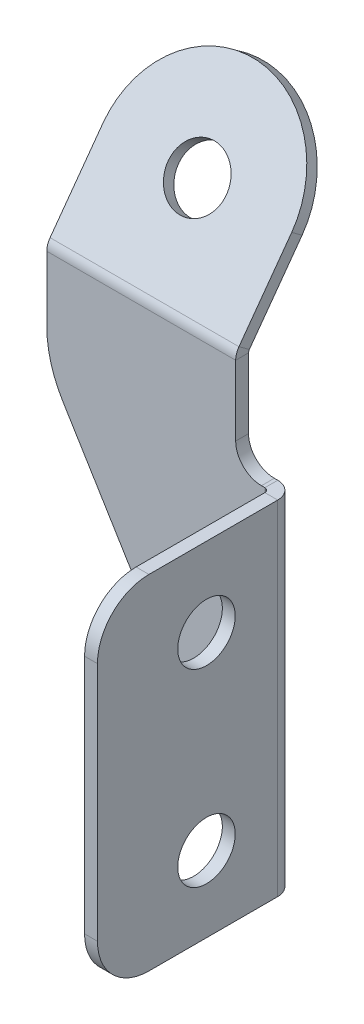
ISO-10303-21;
HEADER;
FILE_DESCRIPTION(('STEP AP214'),'2;1');
FILE_NAME('part.step','',(''),(''),'','','');
FILE_SCHEMA(('AUTOMOTIVE_DESIGN { 1 0 10303 214 1 1 1 1 }'));
ENDSEC;
DATA;
#1=APPLICATION_CONTEXT('core data for automotive mechanical design processes');
#2=APPLICATION_PROTOCOL_DEFINITION('international standard','automotive_design',2000,#1);
#3=PRODUCT_CONTEXT('',#1,'mechanical');
#4=PRODUCT('Part','Part','',(#3));
#5=PRODUCT_RELATED_PRODUCT_CATEGORY('part','',(#4));
#6=PRODUCT_DEFINITION_FORMATION('','',#4);
#7=PRODUCT_DEFINITION_CONTEXT('part definition',#1,'design');
#8=PRODUCT_DEFINITION('design','',#6,#7);
#9=PRODUCT_DEFINITION_SHAPE('','',#8);
#10=(LENGTH_UNIT() NAMED_UNIT(*) SI_UNIT(.MILLI.,.METRE.));
#11=(NAMED_UNIT(*) PLANE_ANGLE_UNIT() SI_UNIT($,.RADIAN.));
#12=(NAMED_UNIT(*) SI_UNIT($,.STERADIAN.) SOLID_ANGLE_UNIT());
#13=UNCERTAINTY_MEASURE_WITH_UNIT(LENGTH_MEASURE(1.E-05),#10,'distance_accuracy_value','');
#14=(GEOMETRIC_REPRESENTATION_CONTEXT(3) GLOBAL_UNCERTAINTY_ASSIGNED_CONTEXT((#13)) GLOBAL_UNIT_ASSIGNED_CONTEXT((#10,
#11,#12)) REPRESENTATION_CONTEXT('',''));
#15=CARTESIAN_POINT('',(0.,0.,0.));
#16=DIRECTION('',(0.,0.,1.));
#17=DIRECTION('',(1.,0.,0.));
#18=AXIS2_PLACEMENT_3D('',#15,#16,#17);
#19=CARTESIAN_POINT('',(147.6,23.2,0.));
#20=DIRECTION('',(1.,0.,0.));
#21=DIRECTION('',(0.,1.,0.));
#22=AXIS2_PLACEMENT_3D('',#19,#20,#21);
#23=PLANE('',#22);
#24=DIRECTION('',(0.,0.,-1.));
#25=VECTOR('',#24,1.);
#26=CARTESIAN_POINT('',(147.6,31.3501606075342,0.));
#27=LINE('',#26,#25);
#28=CARTESIAN_POINT('',(147.6,31.3501606075342,1.5));
#29=VERTEX_POINT('',#28);
#30=CARTESIAN_POINT('',(147.6,31.3501606075342,0.));
#31=VERTEX_POINT('',#30);
#32=EDGE_CURVE('E11',#29,#31,#27,.T.);
#33=ORIENTED_EDGE('',*,*,#32,.F.);
#34=DIRECTION('',(0.,1.,0.));
#35=VECTOR('',#34,1.);
#36=CARTESIAN_POINT('',(147.6,23.2,1.5));
#37=LINE('',#36,#35);
#38=CARTESIAN_POINT('',(147.6,23.2,1.5));
#39=VERTEX_POINT('',#38);
#40=EDGE_CURVE('E121',#39,#29,#37,.T.);
#41=ORIENTED_EDGE('',*,*,#40,.F.);
#42=DIRECTION('',(0.,0.,-1.));
#43=VECTOR('',#42,1.);
#44=CARTESIAN_POINT('',(147.6,23.2,0.));
#45=LINE('',#44,#43);
#46=CARTESIAN_POINT('',(147.6,23.2,0.));
#47=VERTEX_POINT('',#46);
#48=EDGE_CURVE('E48',#39,#47,#45,.T.);
#49=ORIENTED_EDGE('',*,*,#48,.T.);
#50=DIRECTION('',(0.,1.,0.));
#51=VECTOR('',#50,1.);
#52=CARTESIAN_POINT('',(147.6,23.2,0.));
#53=LINE('',#52,#51);
#54=EDGE_CURVE('E124',#47,#31,#53,.T.);
#55=ORIENTED_EDGE('',*,*,#54,.T.);
#56=EDGE_LOOP('',(#33,#41,#49,#55));
#57=FACE_BOUND('',#56,.T.);
#58=ADVANCED_FACE('F38',(#57),#23,.T.);
#59=CARTESIAN_POINT('',(150.6,23.2,0.));
#60=DIRECTION('',(0.,0.,-1.));
#61=DIRECTION('',(-1.,0.,0.));
#62=AXIS2_PLACEMENT_3D('',#59,#60,#61);
#63=CYLINDRICAL_SURFACE('',#62,3.);
#64=ORIENTED_EDGE('',*,*,#48,.F.);
#65=CARTESIAN_POINT('',(150.6,23.2,1.5));
#66=DIRECTION('',(0.,0.,-1.));
#67=DIRECTION('',(-1.,0.,0.));
#68=AXIS2_PLACEMENT_3D('',#65,#66,#67);
#69=CIRCLE('',#68,3.);
#70=CARTESIAN_POINT('',(150.6,20.2,1.5));
#71=VERTEX_POINT('',#70);
#72=EDGE_CURVE('E151',#71,#39,#69,.T.);
#73=ORIENTED_EDGE('',*,*,#72,.F.);
#74=DIRECTION('',(0.,0.,-1.));
#75=VECTOR('',#74,1.);
#76=CARTESIAN_POINT('',(150.6,20.2,0.));
#77=LINE('',#76,#75);
#78=CARTESIAN_POINT('',(150.6,20.2,0.));
#79=VERTEX_POINT('',#78);
#80=EDGE_CURVE('E216',#71,#79,#77,.T.);
#81=ORIENTED_EDGE('',*,*,#80,.T.);
#82=CARTESIAN_POINT('',(150.6,23.2,0.));
#83=DIRECTION('',(0.,0.,-1.));
#84=DIRECTION('',(1.,0.,0.));
#85=AXIS2_PLACEMENT_3D('',#82,#83,#84);
#86=CIRCLE('',#85,3.);
#87=EDGE_CURVE('E230',#79,#47,#86,.T.);
#88=ORIENTED_EDGE('',*,*,#87,.T.);
#89=EDGE_LOOP('',(#64,#73,#81,#88));
#90=FACE_BOUND('',#89,.T.);
#91=ADVANCED_FACE('F238',(#90),#63,.F.);
#92=CARTESIAN_POINT('',(153.,20.2,0.));
#93=DIRECTION('',(0.,1.,0.));
#94=DIRECTION('',(-1.,0.,0.));
#95=AXIS2_PLACEMENT_3D('',#92,#93,#94);
#96=PLANE('',#95);
#97=ORIENTED_EDGE('',*,*,#80,.F.);
#98=DIRECTION('',(1.,0.,0.));
#99=VECTOR('',#98,1.);
#100=CARTESIAN_POINT('',(150.6,20.2,1.5));
#101=LINE('',#100,#99);
#102=CARTESIAN_POINT('',(151.,20.2,1.5));
#103=VERTEX_POINT('',#102);
#104=EDGE_CURVE('E317',#103,#71,#101,.F.);
#105=ORIENTED_EDGE('',*,*,#104,.F.);
#106=DIRECTION('',(0.,0.,-1.));
#107=VECTOR('',#106,1.);
#108=CARTESIAN_POINT('',(151.,20.2,0.));
#109=LINE('',#108,#107);
#110=CARTESIAN_POINT('',(151.,20.2,0.));
#111=VERTEX_POINT('',#110);
#112=EDGE_CURVE('E214',#103,#111,#109,.T.);
#113=ORIENTED_EDGE('',*,*,#112,.T.);
#114=DIRECTION('',(-1.,0.,0.));
#115=VECTOR('',#114,1.);
#116=CARTESIAN_POINT('',(153.,20.2,0.));
#117=LINE('',#116,#115);
#118=EDGE_CURVE('E239',#111,#79,#117,.T.);
#119=ORIENTED_EDGE('',*,*,#118,.T.);
#120=EDGE_LOOP('',(#97,#105,#113,#119));
#121=FACE_BOUND('',#120,.T.);
#122=ADVANCED_FACE('F338',(#121),#96,.T.);
#123=CARTESIAN_POINT('',(151.,20.2,2.));
#124=DIRECTION('',(0.,-1.,0.));
#125=DIRECTION('',(0.,0.,-1.));
#126=AXIS2_PLACEMENT_3D('',#123,#124,#125);
#127=PLANE('',#126);
#128=ORIENTED_EDGE('',*,*,#112,.F.);
#129=CARTESIAN_POINT('',(151.,20.2,2.));
#130=DIRECTION('',(0.,1.,0.));
#131=DIRECTION('',(0.,0.,1.));
#132=AXIS2_PLACEMENT_3D('',#129,#130,#131);
#133=CIRCLE('',#132,0.5);
#134=CARTESIAN_POINT('',(151.5,20.2,2.));
#135=VERTEX_POINT('',#134);
#136=EDGE_CURVE('E163',#103,#135,#133,.F.);
#137=ORIENTED_EDGE('',*,*,#136,.T.);
#138=DIRECTION('',(1.,0.,0.));
#139=VECTOR('',#138,1.);
#140=CARTESIAN_POINT('',(153.,20.2,2.));
#141=LINE('',#140,#139);
#142=CARTESIAN_POINT('',(153.,20.2,2.));
#143=VERTEX_POINT('',#142);
#144=EDGE_CURVE('E211',#135,#143,#141,.T.);
#145=ORIENTED_EDGE('',*,*,#144,.T.);
#146=CARTESIAN_POINT('',(151.,20.2,2.));
#147=DIRECTION('',(0.,1.,0.));
#148=DIRECTION('',(0.,0.,1.));
#149=AXIS2_PLACEMENT_3D('',#146,#147,#148);
#150=CIRCLE('',#149,2.);
#151=EDGE_CURVE('E287',#111,#143,#150,.F.);
#152=ORIENTED_EDGE('',*,*,#151,.F.);
#153=EDGE_LOOP('',(#128,#137,#145,#152));
#154=FACE_BOUND('',#153,.T.);
#155=ADVANCED_FACE('F346',(#154),#127,.F.);
#156=CARTESIAN_POINT('',(153.,20.2,1.5));
#157=DIRECTION('',(0.,1.,0.));
#158=DIRECTION('',(0.,0.,-1.));
#159=AXIS2_PLACEMENT_3D('',#156,#157,#158);
#160=PLANE('',#159);
#161=ORIENTED_EDGE('',*,*,#144,.F.);
#162=DIRECTION('',(0.,0.,1.));
#163=VECTOR('',#162,1.);
#164=CARTESIAN_POINT('',(151.5,20.2,1.5));
#165=LINE('',#164,#163);
#166=CARTESIAN_POINT('',(151.5,20.2,16.9999999999742));
#167=VERTEX_POINT('',#166);
#168=EDGE_CURVE('E161',#167,#135,#165,.F.);
#169=ORIENTED_EDGE('',*,*,#168,.F.);
#170=DIRECTION('',(1.,0.,0.));
#171=VECTOR('',#170,1.);
#172=CARTESIAN_POINT('',(153.,20.2,16.9999999999742));
#173=LINE('',#172,#171);
#174=CARTESIAN_POINT('',(153.,20.2,16.9999999999742));
#175=VERTEX_POINT('',#174);
#176=EDGE_CURVE('E208',#167,#175,#173,.T.);
#177=ORIENTED_EDGE('',*,*,#176,.T.);
#178=DIRECTION('',(0.,0.,-1.));
#179=VECTOR('',#178,1.);
#180=CARTESIAN_POINT('',(153.,20.2,1.5));
#181=LINE('',#180,#179);
#182=EDGE_CURVE('E281',#175,#143,#181,.T.);
#183=ORIENTED_EDGE('',*,*,#182,.T.);
#184=EDGE_LOOP('',(#161,#169,#177,#183));
#185=FACE_BOUND('',#184,.T.);
#186=ADVANCED_FACE('F420',(#185),#160,.T.);
#187=CARTESIAN_POINT('',(153.,14.2,16.9999999999742));
#188=DIRECTION('',(1.,0.,0.));
#189=DIRECTION('',(0.,0.,-1.));
#190=AXIS2_PLACEMENT_3D('',#187,#188,#189);
#191=CYLINDRICAL_SURFACE('',#190,6.);
#192=ORIENTED_EDGE('',*,*,#176,.F.);
#193=CARTESIAN_POINT('',(151.5,14.2,16.9999999999742));
#194=DIRECTION('',(1.,0.,0.));
#195=DIRECTION('',(0.,0.,-1.));
#196=AXIS2_PLACEMENT_3D('',#193,#194,#195);
#197=CIRCLE('',#196,6.);
#198=CARTESIAN_POINT('',(151.5,14.2,22.9999999999742));
#199=VERTEX_POINT('',#198);
#200=EDGE_CURVE('E327',#167,#199,#197,.T.);
#201=ORIENTED_EDGE('',*,*,#200,.T.);
#202=DIRECTION('',(1.,0.,0.));
#203=VECTOR('',#202,1.);
#204=CARTESIAN_POINT('',(153.,14.2,22.9999999999742));
#205=LINE('',#204,#203);
#206=CARTESIAN_POINT('',(153.,14.2,22.9999999999742));
#207=VERTEX_POINT('',#206);
#208=EDGE_CURVE('E205',#199,#207,#205,.T.);
#209=ORIENTED_EDGE('',*,*,#208,.T.);
#210=CARTESIAN_POINT('',(153.,14.2,16.9999999999742));
#211=DIRECTION('',(1.,0.,0.));
#212=DIRECTION('',(0.,0.,-1.));
#213=AXIS2_PLACEMENT_3D('',#210,#211,#212);
#214=CIRCLE('',#213,6.);
#215=EDGE_CURVE('E416',#175,#207,#214,.T.);
#216=ORIENTED_EDGE('',*,*,#215,.F.);
#217=EDGE_LOOP('',(#192,#201,#209,#216));
#218=FACE_BOUND('',#217,.T.);
#219=ADVANCED_FACE('F427',(#218),#191,.T.);
#220=CARTESIAN_POINT('',(153.,14.2,22.9999999999742));
#221=DIRECTION('',(0.,0.,-1.));
#222=DIRECTION('',(0.,-1.,0.));
#223=AXIS2_PLACEMENT_3D('',#220,#221,#222);
#224=PLANE('',#223);
#225=ORIENTED_EDGE('',*,*,#208,.F.);
#226=DIRECTION('',(0.,1.,0.));
#227=VECTOR('',#226,1.);
#228=CARTESIAN_POINT('',(151.5,-19.8,22.9999999999742));
#229=LINE('',#228,#227);
#230=CARTESIAN_POINT('',(151.5,-13.8,22.9999999999742));
#231=VERTEX_POINT('',#230);
#232=EDGE_CURVE('E324',#199,#231,#229,.F.);
#233=ORIENTED_EDGE('',*,*,#232,.T.);
#234=DIRECTION('',(1.,0.,0.));
#235=VECTOR('',#234,1.);
#236=CARTESIAN_POINT('',(153.,-13.8,22.9999999999742));
#237=LINE('',#236,#235);
#238=CARTESIAN_POINT('',(153.,-13.8,22.9999999999742));
#239=VERTEX_POINT('',#238);
#240=EDGE_CURVE('E202',#231,#239,#237,.T.);
#241=ORIENTED_EDGE('',*,*,#240,.T.);
#242=DIRECTION('',(0.,-1.,0.));
#243=VECTOR('',#242,1.);
#244=CARTESIAN_POINT('',(153.,14.2,22.9999999999742));
#245=LINE('',#244,#243);
#246=EDGE_CURVE('E412',#207,#239,#245,.T.);
#247=ORIENTED_EDGE('',*,*,#246,.F.);
#248=EDGE_LOOP('',(#225,#233,#241,#247));
#249=FACE_BOUND('',#248,.T.);
#250=ADVANCED_FACE('F433',(#249),#224,.F.);
#251=CARTESIAN_POINT('',(153.,-13.8,16.9999999999742));
#252=DIRECTION('',(1.,0.,0.));
#253=DIRECTION('',(0.,0.,-1.));
#254=AXIS2_PLACEMENT_3D('',#251,#252,#253);
#255=CYLINDRICAL_SURFACE('',#254,5.99999999999999);
#256=ORIENTED_EDGE('',*,*,#240,.F.);
#257=CARTESIAN_POINT('',(151.5,-13.8,16.9999999999742));
#258=DIRECTION('',(1.,0.,0.));
#259=DIRECTION('',(0.,0.,-1.));
#260=AXIS2_PLACEMENT_3D('',#257,#258,#259);
#261=CIRCLE('',#260,5.99999999999999);
#262=CARTESIAN_POINT('',(151.5,-19.8,16.9999999999742));
#263=VERTEX_POINT('',#262);
#264=EDGE_CURVE('E321',#231,#263,#261,.T.);
#265=ORIENTED_EDGE('',*,*,#264,.T.);
#266=DIRECTION('',(1.,0.,0.));
#267=VECTOR('',#266,1.);
#268=CARTESIAN_POINT('',(153.,-19.8,16.9999999999742));
#269=LINE('',#268,#267);
#270=CARTESIAN_POINT('',(153.,-19.8,16.9999999999742));
#271=VERTEX_POINT('',#270);
#272=EDGE_CURVE('E199',#263,#271,#269,.T.);
#273=ORIENTED_EDGE('',*,*,#272,.T.);
#274=CARTESIAN_POINT('',(153.,-13.8,16.9999999999742));
#275=DIRECTION('',(1.,0.,0.));
#276=DIRECTION('',(0.,0.,1.));
#277=AXIS2_PLACEMENT_3D('',#274,#275,#276);
#278=CIRCLE('',#277,5.99999999999999);
#279=EDGE_CURVE('E409',#239,#271,#278,.T.);
#280=ORIENTED_EDGE('',*,*,#279,.F.);
#281=EDGE_LOOP('',(#256,#265,#273,#280));
#282=FACE_BOUND('',#281,.T.);
#283=ADVANCED_FACE('F439',(#282),#255,.T.);
#284=CARTESIAN_POINT('',(153.,-19.8,1.5));
#285=DIRECTION('',(0.,1.,0.));
#286=DIRECTION('',(0.,0.,-1.));
#287=AXIS2_PLACEMENT_3D('',#284,#285,#286);
#288=PLANE('',#287);
#289=ORIENTED_EDGE('',*,*,#272,.F.);
#290=DIRECTION('',(0.,0.,1.));
#291=VECTOR('',#290,1.);
#292=CARTESIAN_POINT('',(151.5,-19.8,1.5));
#293=LINE('',#292,#291);
#294=CARTESIAN_POINT('',(151.5,-19.8,2.));
#295=VERTEX_POINT('',#294);
#296=EDGE_CURVE('E171',#263,#295,#293,.F.);
#297=ORIENTED_EDGE('',*,*,#296,.T.);
#298=DIRECTION('',(1.,0.,0.));
#299=VECTOR('',#298,1.);
#300=CARTESIAN_POINT('',(153.,-19.8,2.));
#301=LINE('',#300,#299);
#302=CARTESIAN_POINT('',(153.,-19.8,2.));
#303=VERTEX_POINT('',#302);
#304=EDGE_CURVE('E196',#295,#303,#301,.T.);
#305=ORIENTED_EDGE('',*,*,#304,.T.);
#306=DIRECTION('',(0.,0.,-1.));
#307=VECTOR('',#306,1.);
#308=CARTESIAN_POINT('',(153.,-19.8,1.5));
#309=LINE('',#308,#307);
#310=EDGE_CURVE('E399',#271,#303,#309,.T.);
#311=ORIENTED_EDGE('',*,*,#310,.F.);
#312=EDGE_LOOP('',(#289,#297,#305,#311));
#313=FACE_BOUND('',#312,.T.);
#314=ADVANCED_FACE('F398',(#313),#288,.F.);
#315=CARTESIAN_POINT('',(151.,-19.8,2.));
#316=DIRECTION('',(0.,-1.,0.));
#317=DIRECTION('',(0.,0.,-1.));
#318=AXIS2_PLACEMENT_3D('',#315,#316,#317);
#319=PLANE('',#318);
#320=ORIENTED_EDGE('',*,*,#304,.F.);
#321=CARTESIAN_POINT('',(151.,-19.8,2.));
#322=DIRECTION('',(0.,1.,0.));
#323=DIRECTION('',(0.,0.,1.));
#324=AXIS2_PLACEMENT_3D('',#321,#322,#323);
#325=CIRCLE('',#324,0.5);
#326=CARTESIAN_POINT('',(151.,-19.8,1.5));
#327=VERTEX_POINT('',#326);
#328=EDGE_CURVE('E159',#295,#327,#325,.T.);
#329=ORIENTED_EDGE('',*,*,#328,.T.);
#330=DIRECTION('',(0.,0.,-1.));
#331=VECTOR('',#330,1.);
#332=CARTESIAN_POINT('',(151.,-19.8,0.));
#333=LINE('',#332,#331);
#334=CARTESIAN_POINT('',(151.,-19.8,0.));
#335=VERTEX_POINT('',#334);
#336=EDGE_CURVE('E56',#327,#335,#333,.T.);
#337=ORIENTED_EDGE('',*,*,#336,.T.);
#338=CARTESIAN_POINT('',(151.,-19.8,2.));
#339=DIRECTION('',(0.,1.,0.));
#340=DIRECTION('',(0.,0.,1.));
#341=AXIS2_PLACEMENT_3D('',#338,#339,#340);
#342=CIRCLE('',#341,2.);
#343=EDGE_CURVE('E278',#303,#335,#342,.T.);
#344=ORIENTED_EDGE('',*,*,#343,.F.);
#345=EDGE_LOOP('',(#320,#329,#337,#344));
#346=FACE_BOUND('',#345,.T.);
#347=ADVANCED_FACE('F448',(#346),#319,.T.);
#348=CARTESIAN_POINT('',(150.,-19.8,0.));
#349=DIRECTION('',(0.,-1.,0.));
#350=DIRECTION('',(1.,0.,0.));
#351=AXIS2_PLACEMENT_3D('',#348,#349,#350);
#352=PLANE('',#351);
#353=ORIENTED_EDGE('',*,*,#336,.F.);
#354=DIRECTION('',(1.,0.,0.));
#355=VECTOR('',#354,1.);
#356=CARTESIAN_POINT('',(150.6,-19.8,1.5));
#357=LINE('',#356,#355);
#358=CARTESIAN_POINT('',(150.,-19.8,1.5));
#359=VERTEX_POINT('',#358);
#360=EDGE_CURVE('E315',#359,#327,#357,.T.);
#361=ORIENTED_EDGE('',*,*,#360,.F.);
#362=DIRECTION('',(0.,0.,-1.));
#363=VECTOR('',#362,1.);
#364=CARTESIAN_POINT('',(150.,-19.8,0.));
#365=LINE('',#364,#363);
#366=CARTESIAN_POINT('',(150.,-19.8,0.));
#367=VERTEX_POINT('',#366);
#368=EDGE_CURVE('E192',#359,#367,#365,.T.);
#369=ORIENTED_EDGE('',*,*,#368,.T.);
#370=DIRECTION('',(1.,0.,0.));
#371=VECTOR('',#370,1.);
#372=CARTESIAN_POINT('',(150.,-19.8,0.));
#373=LINE('',#372,#371);
#374=EDGE_CURVE('E242',#367,#335,#373,.T.);
#375=ORIENTED_EDGE('',*,*,#374,.T.);
#376=EDGE_LOOP('',(#353,#361,#369,#375));
#377=FACE_BOUND('',#376,.T.);
#378=ADVANCED_FACE('F353',(#377),#352,.T.);
#379=CARTESIAN_POINT('',(150.,-19.8,0.));
#380=DIRECTION('',(-0.853703609872431,-0.520759202022183,0.));
#381=DIRECTION('',(0.520759202022183,-0.853703609872431,0.));
#382=AXIS2_PLACEMENT_3D('',#379,#380,#381);
#383=PLANE('',#382);
#384=ORIENTED_EDGE('',*,*,#368,.F.);
#385=DIRECTION('',(0.520759202022183,-0.853703609872431,0.));
#386=VECTOR('',#385,1.);
#387=CARTESIAN_POINT('',(150.,-19.8,1.5));
#388=LINE('',#387,#386);
#389=CARTESIAN_POINT('',(127.45796415462,17.1541571235735,1.5));
#390=VERTEX_POINT('',#389);
#391=EDGE_CURVE('E312',#390,#359,#388,.T.);
#392=ORIENTED_EDGE('',*,*,#391,.F.);
#393=DIRECTION('',(0.,0.,-1.));
#394=VECTOR('',#393,1.);
#395=CARTESIAN_POINT('',(127.45796415462,17.1541571235735,0.));
#396=LINE('',#395,#394);
#397=CARTESIAN_POINT('',(127.45796415462,17.1541571235735,0.));
#398=VERTEX_POINT('',#397);
#399=EDGE_CURVE('E189',#390,#398,#396,.T.);
#400=ORIENTED_EDGE('',*,*,#399,.T.);
#401=DIRECTION('',(0.520759202022183,-0.853703609872431,0.));
#402=VECTOR('',#401,1.);
#403=CARTESIAN_POINT('',(150.,-19.8,0.));
#404=LINE('',#403,#402);
#405=EDGE_CURVE('E251',#398,#367,#404,.T.);
#406=ORIENTED_EDGE('',*,*,#405,.T.);
#407=EDGE_LOOP('',(#384,#392,#400,#406));
#408=FACE_BOUND('',#407,.T.);
#409=ADVANCED_FACE('F360',(#408),#383,.T.);
#410=CARTESIAN_POINT('',(138.3,23.7677989892553,0.));
#411=DIRECTION('',(0.,0.,1.));
#412=DIRECTION('',(1.,0.,0.));
#413=AXIS2_PLACEMENT_3D('',#410,#411,#412);
#414=CYLINDRICAL_SURFACE('',#413,12.7);
#415=ORIENTED_EDGE('',*,*,#399,.F.);
#416=CARTESIAN_POINT('',(138.3,23.7677989892553,1.5));
#417=DIRECTION('',(0.,0.,1.));
#418=DIRECTION('',(1.,0.,0.));
#419=AXIS2_PLACEMENT_3D('',#416,#417,#418);
#420=CIRCLE('',#419,12.7);
#421=CARTESIAN_POINT('',(125.6,23.7677989892553,1.5));
#422=VERTEX_POINT('',#421);
#423=EDGE_CURVE('E309',#422,#390,#420,.T.);
#424=ORIENTED_EDGE('',*,*,#423,.F.);
#425=DIRECTION('',(0.,0.,-1.));
#426=VECTOR('',#425,1.);
#427=CARTESIAN_POINT('',(125.6,23.7677989892553,0.));
#428=LINE('',#427,#426);
#429=CARTESIAN_POINT('',(125.6,23.7677989892553,0.));
#430=VERTEX_POINT('',#429);
#431=EDGE_CURVE('E186',#422,#430,#428,.T.);
#432=ORIENTED_EDGE('',*,*,#431,.T.);
#433=CARTESIAN_POINT('',(138.3,23.7677989892553,0.));
#434=DIRECTION('',(0.,0.,1.));
#435=DIRECTION('',(1.,0.,0.));
#436=AXIS2_PLACEMENT_3D('',#433,#434,#435);
#437=CIRCLE('',#436,12.7);
#438=EDGE_CURVE('E254',#430,#398,#437,.T.);
#439=ORIENTED_EDGE('',*,*,#438,.T.);
#440=EDGE_LOOP('',(#415,#424,#432,#439));
#441=FACE_BOUND('',#440,.T.);
#442=ADVANCED_FACE('F365',(#441),#414,.T.);
#443=CARTESIAN_POINT('',(125.6,32.,0.));
#444=DIRECTION('',(-1.,0.,0.));
#445=DIRECTION('',(0.,-1.,0.));
#446=AXIS2_PLACEMENT_3D('',#443,#444,#445);
#447=PLANE('',#446);
#448=ORIENTED_EDGE('',*,*,#431,.F.);
#449=DIRECTION('',(0.,1.,0.));
#450=VECTOR('',#449,1.);
#451=CARTESIAN_POINT('',(125.6,23.2,1.5));
#452=LINE('',#451,#450);
#453=CARTESIAN_POINT('',(125.6,31.3501606075342,1.5));
#454=VERTEX_POINT('',#453);
#455=EDGE_CURVE('E153',#454,#422,#452,.F.);
#456=ORIENTED_EDGE('',*,*,#455,.F.);
#457=DIRECTION('',(0.,0.,-1.));
#458=VECTOR('',#457,1.);
#459=CARTESIAN_POINT('',(125.6,31.3501606075342,0.));
#460=LINE('',#459,#458);
#461=CARTESIAN_POINT('',(125.6,31.3501606075342,0.));
#462=VERTEX_POINT('',#461);
#463=EDGE_CURVE('E183',#454,#462,#460,.T.);
#464=ORIENTED_EDGE('',*,*,#463,.T.);
#465=DIRECTION('',(0.,-1.,0.));
#466=VECTOR('',#465,1.);
#467=CARTESIAN_POINT('',(125.6,32.,0.));
#468=LINE('',#467,#466);
#469=EDGE_CURVE('E236',#462,#430,#468,.T.);
#470=ORIENTED_EDGE('',*,*,#469,.T.);
#471=EDGE_LOOP('',(#448,#456,#464,#470));
#472=FACE_BOUND('',#471,.T.);
#473=ADVANCED_FACE('F367',(#472),#447,.T.);
#474=CARTESIAN_POINT('',(125.6,31.3501606075342,-0.5));
#475=DIRECTION('',(-1.,0.,0.));
#476=DIRECTION('',(0.,0.,1.));
#477=AXIS2_PLACEMENT_3D('',#474,#475,#476);
#478=PLANE('',#477);
#479=ORIENTED_EDGE('',*,*,#463,.F.);
#480=CARTESIAN_POINT('',(125.6,31.3501606075342,-0.5));
#481=DIRECTION('',(1.,0.,0.));
#482=DIRECTION('',(0.,0.,-1.));
#483=AXIS2_PLACEMENT_3D('',#480,#481,#482);
#484=CIRCLE('',#483,2.);
#485=CARTESIAN_POINT('',(125.6,32.5257311121191,1.1180339887499));
#486=VERTEX_POINT('',#485);
#487=EDGE_CURVE('E140',#454,#486,#484,.F.);
#488=ORIENTED_EDGE('',*,*,#487,.T.);
#489=DIRECTION('',(0.,-0.587785252292474,-0.809016994374947));
#490=VECTOR('',#489,1.);
#491=CARTESIAN_POINT('',(125.6,31.6440532336804,-0.0954915028125261));
#492=LINE('',#491,#490);
#493=CARTESIAN_POINT('',(125.6,31.6440532336804,-0.0954915028125261));
#494=VERTEX_POINT('',#493);
#495=EDGE_CURVE('E180',#486,#494,#492,.T.);
#496=ORIENTED_EDGE('',*,*,#495,.T.);
#497=CARTESIAN_POINT('',(125.6,31.3501606075342,-0.5));
#498=DIRECTION('',(1.,0.,0.));
#499=DIRECTION('',(0.,0.,-1.));
#500=AXIS2_PLACEMENT_3D('',#497,#498,#499);
#501=CIRCLE('',#500,0.5);
#502=EDGE_CURVE('E277',#462,#494,#501,.F.);
#503=ORIENTED_EDGE('',*,*,#502,.F.);
#504=EDGE_LOOP('',(#479,#488,#496,#503));
#505=FACE_BOUND('',#504,.T.);
#506=ADVANCED_FACE('F374',(#505),#478,.T.);
#507=CARTESIAN_POINT('',(125.6,31.1183221215613,0.28647450843758));
#508=DIRECTION('',(1.,0.,0.));
#509=DIRECTION('',(0.,-0.809016994374946,0.587785252292474));
#510=AXIS2_PLACEMENT_3D('',#507,#508,#509);
#511=PLANE('',#510);
#512=ORIENTED_EDGE('',*,*,#495,.F.);
#513=DIRECTION('',(0.,0.809016994374947,-0.587785252292474));
#514=VECTOR('',#513,1.);
#515=CARTESIAN_POINT('',(125.6,40.9800886375619,-5.02441630044647));
#516=LINE('',#515,#514);
#517=CARTESIAN_POINT('',(125.6,40.9800886375619,-5.02441630044647));
#518=VERTEX_POINT('',#517);
#519=EDGE_CURVE('E300',#518,#486,#516,.F.);
#520=ORIENTED_EDGE('',*,*,#519,.F.);
#521=DIRECTION('',(0.,-0.587785252292474,-0.809016994374947));
#522=VECTOR('',#521,1.);
#523=CARTESIAN_POINT('',(125.6,40.0984107591232,-6.23794179200889));
#524=LINE('',#523,#522);
#525=CARTESIAN_POINT('',(125.6,40.0984107591232,-6.23794179200889));
#526=VERTEX_POINT('',#525);
#527=EDGE_CURVE('E177',#518,#526,#524,.T.);
#528=ORIENTED_EDGE('',*,*,#527,.T.);
#529=DIRECTION('',(0.,-0.809016994374946,0.587785252292474));
#530=VECTOR('',#529,1.);
#531=CARTESIAN_POINT('',(125.6,31.1183221215613,0.28647450843758));
#532=LINE('',#531,#530);
#533=EDGE_CURVE('E261',#526,#494,#532,.T.);
#534=ORIENTED_EDGE('',*,*,#533,.T.);
#535=EDGE_LOOP('',(#512,#520,#528,#534));
#536=FACE_BOUND('',#535,.T.);
#537=ADVANCED_FACE('F497',(#536),#511,.F.);
#538=CARTESIAN_POINT('',(136.6,40.0984107591232,-6.23794179200889));
#539=DIRECTION('',(0.,0.587785252292474,0.809016994374947));
#540=DIRECTION('',(0.,-0.809016994374947,0.587785252292474));
#541=AXIS2_PLACEMENT_3D('',#538,#539,#540);
#542=CYLINDRICAL_SURFACE('',#541,11.);
#543=ORIENTED_EDGE('',*,*,#527,.F.);
#544=CARTESIAN_POINT('',(136.6,40.9800886375619,-5.02441630044647));
#545=DIRECTION('',(0.,0.587785252292474,0.809016994374947));
#546=DIRECTION('',(0.,-0.809016994374947,0.587785252292474));
#547=AXIS2_PLACEMENT_3D('',#544,#545,#546);
#548=CIRCLE('',#547,11.);
#549=CARTESIAN_POINT('',(147.6,40.9800886375619,-5.02441630044648));
#550=VERTEX_POINT('',#549);
#551=EDGE_CURVE('E303',#550,#518,#548,.T.);
#552=ORIENTED_EDGE('',*,*,#551,.F.);
#553=DIRECTION('',(0.,-0.587785252292474,-0.809016994374947));
#554=VECTOR('',#553,1.);
#555=CARTESIAN_POINT('',(147.6,40.0984107591232,-6.2379417920089));
#556=LINE('',#555,#554);
#557=CARTESIAN_POINT('',(147.6,40.0984107591232,-6.2379417920089));
#558=VERTEX_POINT('',#557);
#559=EDGE_CURVE('E174',#550,#558,#556,.T.);
#560=ORIENTED_EDGE('',*,*,#559,.T.);
#561=CARTESIAN_POINT('',(136.6,40.0984107591232,-6.23794179200889));
#562=DIRECTION('',(0.,0.587785252292474,0.809016994374947));
#563=DIRECTION('',(0.,0.809016994374947,-0.587785252292474));
#564=AXIS2_PLACEMENT_3D('',#561,#562,#563);
#565=CIRCLE('',#564,11.);
#566=EDGE_CURVE('E264',#558,#526,#565,.T.);
#567=ORIENTED_EDGE('',*,*,#566,.T.);
#568=EDGE_LOOP('',(#543,#552,#560,#567));
#569=FACE_BOUND('',#568,.T.);
#570=ADVANCED_FACE('F469',(#569),#542,.T.);
#571=CARTESIAN_POINT('',(147.6,31.1183221215613,0.28647450843758));
#572=DIRECTION('',(-1.,0.,0.));
#573=DIRECTION('',(0.,0.809016994374947,-0.587785252292474));
#574=AXIS2_PLACEMENT_3D('',#571,#572,#573);
#575=PLANE('',#574);
#576=ORIENTED_EDGE('',*,*,#559,.F.);
#577=DIRECTION('',(0.,0.809016994374947,-0.587785252292474));
#578=VECTOR('',#577,1.);
#579=CARTESIAN_POINT('',(147.6,40.9800886375619,-5.02441630044647));
#580=LINE('',#579,#578);
#581=CARTESIAN_POINT('',(147.6,32.5257311121191,1.11803398874989));
#582=VERTEX_POINT('',#581);
#583=EDGE_CURVE('E145',#582,#550,#580,.T.);
#584=ORIENTED_EDGE('',*,*,#583,.F.);
#585=DIRECTION('',(0.,-0.587785252292472,-0.809016994374948));
#586=VECTOR('',#585,1.);
#587=CARTESIAN_POINT('',(147.6,31.6440532336804,-0.0954915028125258));
#588=LINE('',#587,#586);
#589=CARTESIAN_POINT('',(147.6,31.6440532336804,-0.0954915028125258));
#590=VERTEX_POINT('',#589);
#591=EDGE_CURVE('E42',#582,#590,#588,.T.);
#592=ORIENTED_EDGE('',*,*,#591,.T.);
#593=DIRECTION('',(0.,0.809016994374947,-0.587785252292474));
#594=VECTOR('',#593,1.);
#595=CARTESIAN_POINT('',(147.6,31.1183221215613,0.28647450843758));
#596=LINE('',#595,#594);
#597=EDGE_CURVE('E267',#590,#558,#596,.T.);
#598=ORIENTED_EDGE('',*,*,#597,.T.);
#599=EDGE_LOOP('',(#576,#584,#592,#598));
#600=FACE_BOUND('',#599,.T.);
#601=ADVANCED_FACE('F388',(#600),#575,.F.);
#602=CARTESIAN_POINT('',(153.,-11.,10.2999999999742));
#603=DIRECTION('',(1.,0.,0.));
#604=DIRECTION('',(0.,0.,-1.));
#605=AXIS2_PLACEMENT_3D('',#602,#603,#604);
#606=CYLINDRICAL_SURFACE('',#605,3.35);
#607=CARTESIAN_POINT('',(153.,-11.,10.2999999999742));
#608=DIRECTION('',(1.,0.,0.));
#609=DIRECTION('',(0.,0.,-1.));
#610=AXIS2_PLACEMENT_3D('',#607,#608,#609);
#611=CIRCLE('',#610,3.35);
#612=CARTESIAN_POINT('',(153.,-11.,6.94999999997425));
#613=VERTEX_POINT('',#612);
#614=EDGE_CURVE('E245',#613,#613,#611,.T.);
#615=ORIENTED_EDGE('',*,*,#614,.T.);
#616=EDGE_LOOP('',(#615));
#617=FACE_BOUND('',#616,.T.);
#618=CARTESIAN_POINT('',(151.5,-11.,10.2999999999742));
#619=DIRECTION('',(1.,0.,0.));
#620=DIRECTION('',(0.,0.,-1.));
#621=AXIS2_PLACEMENT_3D('',#618,#619,#620);
#622=CIRCLE('',#621,3.35);
#623=CARTESIAN_POINT('',(151.5,-11.,6.94999999997425));
#624=VERTEX_POINT('',#623);
#625=EDGE_CURVE('E167',#624,#624,#622,.T.);
#626=ORIENTED_EDGE('',*,*,#625,.F.);
#627=EDGE_LOOP('',(#626));
#628=FACE_BOUND('',#627,.T.);
#629=ADVANCED_FACE('F461',(#617,#628),#606,.F.);
#630=CARTESIAN_POINT('',(153.,11.,10.2999999999742));
#631=DIRECTION('',(1.,0.,0.));
#632=DIRECTION('',(0.,0.,-1.));
#633=AXIS2_PLACEMENT_3D('',#630,#631,#632);
#634=CYLINDRICAL_SURFACE('',#633,3.35);
#635=CARTESIAN_POINT('',(153.,11.,10.2999999999742));
#636=DIRECTION('',(1.,0.,0.));
#637=DIRECTION('',(0.,0.,-1.));
#638=AXIS2_PLACEMENT_3D('',#635,#636,#637);
#639=CIRCLE('',#638,3.35);
#640=CARTESIAN_POINT('',(153.,11.,6.94999999997425));
#641=VERTEX_POINT('',#640);
#642=EDGE_CURVE('E240',#641,#641,#639,.T.);
#643=ORIENTED_EDGE('',*,*,#642,.T.);
#644=EDGE_LOOP('',(#643));
#645=FACE_BOUND('',#644,.T.);
#646=CARTESIAN_POINT('',(151.5,11.,10.2999999999742));
#647=DIRECTION('',(1.,0.,0.));
#648=DIRECTION('',(0.,0.,-1.));
#649=AXIS2_PLACEMENT_3D('',#646,#647,#648);
#650=CIRCLE('',#649,3.35);
#651=CARTESIAN_POINT('',(151.5,11.,6.94999999997425));
#652=VERTEX_POINT('',#651);
#653=EDGE_CURVE('E170',#652,#652,#650,.T.);
#654=ORIENTED_EDGE('',*,*,#653,.F.);
#655=EDGE_LOOP('',(#654));
#656=FACE_BOUND('',#655,.T.);
#657=ADVANCED_FACE('F40',(#645,#656),#634,.F.);
#658=CARTESIAN_POINT('',(136.6,40.0984107591232,-6.23794179200889));
#659=DIRECTION('',(0.,0.587785252292474,0.809016994374947));
#660=DIRECTION('',(0.,-0.809016994374947,0.587785252292474));
#661=AXIS2_PLACEMENT_3D('',#658,#659,#660);
#662=CYLINDRICAL_SURFACE('',#661,3.4);
#663=CARTESIAN_POINT('',(136.6,40.0984107591232,-6.23794179200889));
#664=DIRECTION('',(0.,0.587785252292474,0.809016994374947));
#665=DIRECTION('',(0.,-0.809016994374947,0.587785252292474));
#666=AXIS2_PLACEMENT_3D('',#663,#664,#665);
#667=CIRCLE('',#666,3.4);
#668=CARTESIAN_POINT('',(136.6,37.3477529782484,-4.23947193421448));
#669=VERTEX_POINT('',#668);
#670=EDGE_CURVE('E235',#669,#669,#667,.T.);
#671=ORIENTED_EDGE('',*,*,#670,.F.);
#672=EDGE_LOOP('',(#671));
#673=FACE_BOUND('',#672,.T.);
#674=CARTESIAN_POINT('',(136.6,40.9800886375619,-5.02441630044647));
#675=DIRECTION('',(0.,0.587785252292474,0.809016994374947));
#676=DIRECTION('',(0.,-0.809016994374947,0.587785252292474));
#677=AXIS2_PLACEMENT_3D('',#674,#675,#676);
#678=CIRCLE('',#677,3.4);
#679=CARTESIAN_POINT('',(136.6,38.2294308566871,-3.02594644265206));
#680=VERTEX_POINT('',#679);
#681=EDGE_CURVE('E152',#680,#680,#678,.T.);
#682=ORIENTED_EDGE('',*,*,#681,.T.);
#683=EDGE_LOOP('',(#682));
#684=FACE_BOUND('',#683,.T.);
#685=ADVANCED_FACE('F460',(#673,#684),#662,.F.);
#686=CARTESIAN_POINT('',(147.6,31.3501606075342,-0.5));
#687=DIRECTION('',(1.,0.,0.));
#688=DIRECTION('',(0.,0.,-1.));
#689=AXIS2_PLACEMENT_3D('',#686,#687,#688);
#690=PLANE('',#689);
#691=CARTESIAN_POINT('',(147.6,31.3501606075342,-0.5));
#692=DIRECTION('',(1.,0.,0.));
#693=DIRECTION('',(0.,0.,-1.));
#694=AXIS2_PLACEMENT_3D('',#691,#692,#693);
#695=CIRCLE('',#694,2.);
#696=EDGE_CURVE('E137',#582,#29,#695,.T.);
#697=ORIENTED_EDGE('',*,*,#696,.T.);
#698=ORIENTED_EDGE('',*,*,#32,.T.);
#699=CARTESIAN_POINT('',(147.6,31.3501606075342,-0.5));
#700=DIRECTION('',(-1.,0.,0.));
#701=DIRECTION('',(0.,0.,1.));
#702=AXIS2_PLACEMENT_3D('',#699,#700,#701);
#703=CIRCLE('',#702,0.5);
#704=EDGE_CURVE('E275',#590,#31,#703,.F.);
#705=ORIENTED_EDGE('',*,*,#704,.F.);
#706=ORIENTED_EDGE('',*,*,#591,.F.);
#707=EDGE_LOOP('',(#697,#698,#705,#706));
#708=FACE_BOUND('',#707,.T.);
#709=ADVANCED_FACE('F156',(#708),#690,.T.);
#710=CARTESIAN_POINT('',(136.6,40.0984107591232,-6.23794179200889));
#711=DIRECTION('',(0.,-0.587785252292474,-0.809016994374947));
#712=DIRECTION('',(0.,0.809016994374947,-0.587785252292474));
#713=AXIS2_PLACEMENT_3D('',#710,#711,#712);
#714=PLANE('',#713);
#715=ORIENTED_EDGE('',*,*,#670,.T.);
#716=EDGE_LOOP('',(#715));
#717=FACE_BOUND('',#716,.T.);
#718=ORIENTED_EDGE('',*,*,#597,.F.);
#719=DIRECTION('',(1.,0.,0.));
#720=VECTOR('',#719,1.);
#721=CARTESIAN_POINT('',(136.6,31.6440532336804,-0.0954915028125282));
#722=LINE('',#721,#720);
#723=EDGE_CURVE('E271',#590,#494,#722,.F.);
#724=ORIENTED_EDGE('',*,*,#723,.T.);
#725=ORIENTED_EDGE('',*,*,#533,.F.);
#726=ORIENTED_EDGE('',*,*,#566,.F.);
#727=EDGE_LOOP('',(#718,#724,#725,#726));
#728=FACE_BOUND('',#727,.T.);
#729=ADVANCED_FACE('F385',(#717,#728),#714,.T.);
#730=CARTESIAN_POINT('',(150.6,23.2,0.));
#731=DIRECTION('',(0.,0.,1.));
#732=DIRECTION('',(1.,0.,0.));
#733=AXIS2_PLACEMENT_3D('',#730,#731,#732);
#734=PLANE('',#733);
#735=ORIENTED_EDGE('',*,*,#118,.F.);
#736=DIRECTION('',(0.,1.,0.));
#737=VECTOR('',#736,1.);
#738=CARTESIAN_POINT('',(151.,23.2,0.));
#739=LINE('',#738,#737);
#740=EDGE_CURVE('E284',#111,#335,#739,.F.);
#741=ORIENTED_EDGE('',*,*,#740,.T.);
#742=ORIENTED_EDGE('',*,*,#374,.F.);
#743=ORIENTED_EDGE('',*,*,#405,.F.);
#744=ORIENTED_EDGE('',*,*,#438,.F.);
#745=ORIENTED_EDGE('',*,*,#469,.F.);
#746=DIRECTION('',(1.,0.,0.));
#747=VECTOR('',#746,1.);
#748=CARTESIAN_POINT('',(150.6,31.3501606075342,0.));
#749=LINE('',#748,#747);
#750=EDGE_CURVE('E234',#462,#31,#749,.T.);
#751=ORIENTED_EDGE('',*,*,#750,.T.);
#752=ORIENTED_EDGE('',*,*,#54,.F.);
#753=ORIENTED_EDGE('',*,*,#87,.F.);
#754=EDGE_LOOP('',(#735,#741,#742,#743,#744,#745,#751,#752,#753));
#755=FACE_BOUND('',#754,.T.);
#756=ADVANCED_FACE('F228',(#755),#734,.F.);
#757=CARTESIAN_POINT('',(153.,-19.8,1.5));
#758=DIRECTION('',(-1.,0.,0.));
#759=DIRECTION('',(0.,0.,1.));
#760=AXIS2_PLACEMENT_3D('',#757,#758,#759);
#761=PLANE('',#760);
#762=ORIENTED_EDGE('',*,*,#310,.T.);
#763=DIRECTION('',(0.,1.,0.));
#764=VECTOR('',#763,1.);
#765=CARTESIAN_POINT('',(153.,-19.8,2.));
#766=LINE('',#765,#764);
#767=EDGE_CURVE('E274',#303,#143,#766,.T.);
#768=ORIENTED_EDGE('',*,*,#767,.T.);
#769=ORIENTED_EDGE('',*,*,#182,.F.);
#770=ORIENTED_EDGE('',*,*,#215,.T.);
#771=ORIENTED_EDGE('',*,*,#246,.T.);
#772=ORIENTED_EDGE('',*,*,#279,.T.);
#773=EDGE_LOOP('',(#762,#768,#769,#770,#771,#772));
#774=FACE_BOUND('',#773,.T.);
#775=ORIENTED_EDGE('',*,*,#614,.F.);
#776=EDGE_LOOP('',(#775));
#777=FACE_BOUND('',#776,.T.);
#778=ORIENTED_EDGE('',*,*,#642,.F.);
#779=EDGE_LOOP('',(#778));
#780=FACE_BOUND('',#779,.T.);
#781=ADVANCED_FACE('F404',(#774,#777,#780),#761,.F.);
#782=CARTESIAN_POINT('',(150.6,31.3501606075342,-0.5));
#783=DIRECTION('',(1.,0.,0.));
#784=DIRECTION('',(0.,0.,-1.));
#785=AXIS2_PLACEMENT_3D('',#782,#783,#784);
#786=CYLINDRICAL_SURFACE('',#785,0.5);
#787=ORIENTED_EDGE('',*,*,#502,.T.);
#788=ORIENTED_EDGE('',*,*,#723,.F.);
#789=ORIENTED_EDGE('',*,*,#704,.T.);
#790=ORIENTED_EDGE('',*,*,#750,.F.);
#791=EDGE_LOOP('',(#787,#788,#789,#790));
#792=FACE_BOUND('',#791,.T.);
#793=ADVANCED_FACE('F378',(#792),#786,.F.);
#794=CARTESIAN_POINT('',(151.,-19.8,2.));
#795=DIRECTION('',(0.,1.,0.));
#796=DIRECTION('',(0.,0.,1.));
#797=AXIS2_PLACEMENT_3D('',#794,#795,#796);
#798=CYLINDRICAL_SURFACE('',#797,2.);
#799=ORIENTED_EDGE('',*,*,#343,.T.);
#800=ORIENTED_EDGE('',*,*,#740,.F.);
#801=ORIENTED_EDGE('',*,*,#151,.T.);
#802=ORIENTED_EDGE('',*,*,#767,.F.);
#803=EDGE_LOOP('',(#799,#800,#801,#802));
#804=FACE_BOUND('',#803,.T.);
#805=ADVANCED_FACE('F351',(#804),#798,.T.);
#806=CARTESIAN_POINT('',(136.6,40.9800886375619,-5.02441630044647));
#807=DIRECTION('',(0.,-0.587785252292474,-0.809016994374947));
#808=DIRECTION('',(0.,0.809016994374947,-0.587785252292474));
#809=AXIS2_PLACEMENT_3D('',#806,#807,#808);
#810=PLANE('',#809);
#811=ORIENTED_EDGE('',*,*,#681,.F.);
#812=EDGE_LOOP('',(#811));
#813=FACE_BOUND('',#812,.T.);
#814=ORIENTED_EDGE('',*,*,#583,.T.);
#815=ORIENTED_EDGE('',*,*,#551,.T.);
#816=ORIENTED_EDGE('',*,*,#519,.T.);
#817=DIRECTION('',(1.,0.,0.));
#818=VECTOR('',#817,1.);
#819=CARTESIAN_POINT('',(136.6,32.5257311121191,1.11803398874989));
#820=LINE('',#819,#818);
#821=EDGE_CURVE('E144',#582,#486,#820,.F.);
#822=ORIENTED_EDGE('',*,*,#821,.F.);
#823=EDGE_LOOP('',(#814,#815,#816,#822));
#824=FACE_BOUND('',#823,.T.);
#825=ADVANCED_FACE('F485',(#813,#824),#810,.F.);
#826=CARTESIAN_POINT('',(150.6,23.2,1.5));
#827=DIRECTION('',(0.,0.,1.));
#828=DIRECTION('',(1.,0.,0.));
#829=AXIS2_PLACEMENT_3D('',#826,#827,#828);
#830=PLANE('',#829);
#831=ORIENTED_EDGE('',*,*,#104,.T.);
#832=ORIENTED_EDGE('',*,*,#72,.T.);
#833=ORIENTED_EDGE('',*,*,#40,.T.);
#834=DIRECTION('',(1.,0.,0.));
#835=VECTOR('',#834,1.);
#836=CARTESIAN_POINT('',(150.6,31.3501606075342,1.5));
#837=LINE('',#836,#835);
#838=EDGE_CURVE('E134',#454,#29,#837,.T.);
#839=ORIENTED_EDGE('',*,*,#838,.F.);
#840=ORIENTED_EDGE('',*,*,#455,.T.);
#841=ORIENTED_EDGE('',*,*,#423,.T.);
#842=ORIENTED_EDGE('',*,*,#391,.T.);
#843=ORIENTED_EDGE('',*,*,#360,.T.);
#844=DIRECTION('',(0.,1.,0.));
#845=VECTOR('',#844,1.);
#846=CARTESIAN_POINT('',(151.,23.2,1.5));
#847=LINE('',#846,#845);
#848=EDGE_CURVE('E290',#103,#327,#847,.F.);
#849=ORIENTED_EDGE('',*,*,#848,.F.);
#850=EDGE_LOOP('',(#831,#832,#833,#839,#840,#841,#842,#843,#849));
#851=FACE_BOUND('',#850,.T.);
#852=ADVANCED_FACE('F149',(#851),#830,.T.);
#853=CARTESIAN_POINT('',(151.5,-19.8,1.5));
#854=DIRECTION('',(-1.,0.,0.));
#855=DIRECTION('',(0.,0.,1.));
#856=AXIS2_PLACEMENT_3D('',#853,#854,#855);
#857=PLANE('',#856);
#858=ORIENTED_EDGE('',*,*,#296,.F.);
#859=ORIENTED_EDGE('',*,*,#264,.F.);
#860=ORIENTED_EDGE('',*,*,#232,.F.);
#861=ORIENTED_EDGE('',*,*,#200,.F.);
#862=ORIENTED_EDGE('',*,*,#168,.T.);
#863=DIRECTION('',(0.,1.,0.));
#864=VECTOR('',#863,1.);
#865=CARTESIAN_POINT('',(151.5,-19.8,2.));
#866=LINE('',#865,#864);
#867=EDGE_CURVE('E292',#295,#135,#866,.T.);
#868=ORIENTED_EDGE('',*,*,#867,.F.);
#869=EDGE_LOOP('',(#858,#859,#860,#861,#862,#868));
#870=FACE_BOUND('',#869,.T.);
#871=ORIENTED_EDGE('',*,*,#625,.T.);
#872=EDGE_LOOP('',(#871));
#873=FACE_BOUND('',#872,.T.);
#874=ORIENTED_EDGE('',*,*,#653,.T.);
#875=EDGE_LOOP('',(#874));
#876=FACE_BOUND('',#875,.T.);
#877=ADVANCED_FACE('F436',(#870,#873,#876),#857,.T.);
#878=CARTESIAN_POINT('',(150.6,31.3501606075342,-0.5));
#879=DIRECTION('',(1.,0.,0.));
#880=DIRECTION('',(0.,0.,-1.));
#881=AXIS2_PLACEMENT_3D('',#878,#879,#880);
#882=CYLINDRICAL_SURFACE('',#881,2.);
#883=ORIENTED_EDGE('',*,*,#487,.F.);
#884=ORIENTED_EDGE('',*,*,#838,.T.);
#885=ORIENTED_EDGE('',*,*,#696,.F.);
#886=ORIENTED_EDGE('',*,*,#821,.T.);
#887=EDGE_LOOP('',(#883,#884,#885,#886));
#888=FACE_BOUND('',#887,.T.);
#889=ADVANCED_FACE('F135',(#888),#882,.T.);
#890=CARTESIAN_POINT('',(151.,-19.8,2.));
#891=DIRECTION('',(0.,1.,0.));
#892=DIRECTION('',(0.,0.,1.));
#893=AXIS2_PLACEMENT_3D('',#890,#891,#892);
#894=CYLINDRICAL_SURFACE('',#893,0.5);
#895=ORIENTED_EDGE('',*,*,#328,.F.);
#896=ORIENTED_EDGE('',*,*,#867,.T.);
#897=ORIENTED_EDGE('',*,*,#136,.F.);
#898=ORIENTED_EDGE('',*,*,#848,.T.);
#899=EDGE_LOOP('',(#895,#896,#897,#898));
#900=FACE_BOUND('',#899,.T.);
#901=ADVANCED_FACE('F483',(#900),#894,.F.);
#902=CLOSED_SHELL('',(#58,#91,#122,#155,#186,#219,#250,#283,#314,#347,#378,#409,#442,#473,#506,
#537,#570,#601,#629,#657,#685,#709,#729,#756,#781,#793,#805,#825,#852,#877,#889,#901));
#903=MANIFOLD_SOLID_BREP('B2',#902);
#904=ADVANCED_BREP_SHAPE_REPRESENTATION('',(#18,#903),#14);
#905=SHAPE_DEFINITION_REPRESENTATION(#9,#904);
ENDSEC;
END-ISO-10303-21;
